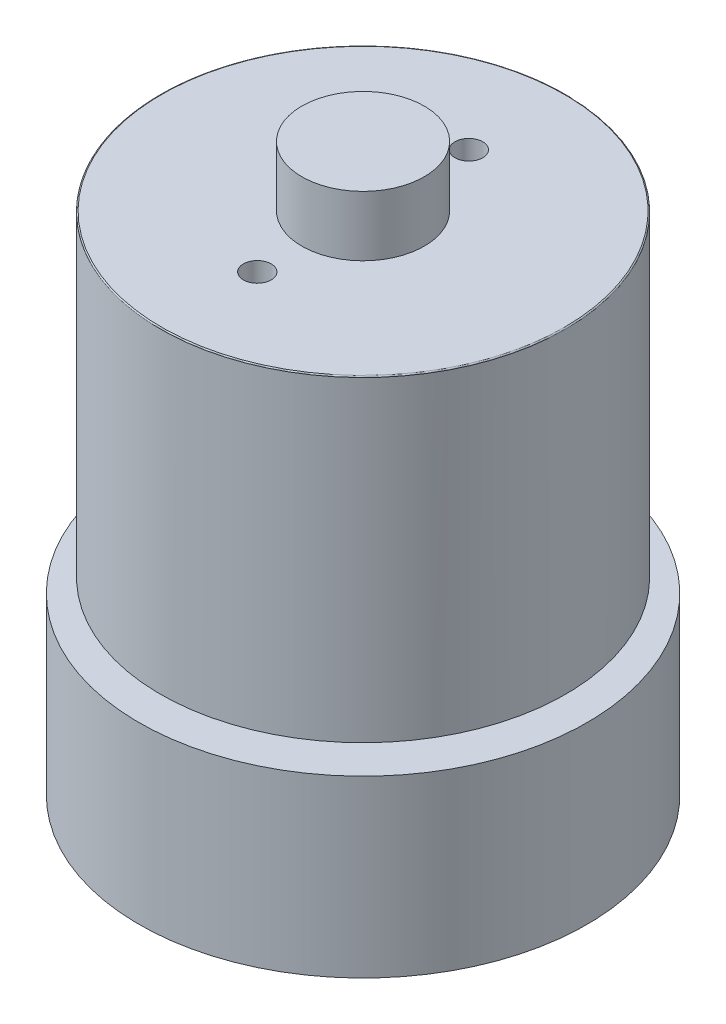
ISO-10303-21;
HEADER;
FILE_DESCRIPTION(('STEP AP214'),'2;1');
FILE_NAME('part.step','',(''),(''),'','','');
FILE_SCHEMA(('AUTOMOTIVE_DESIGN { 1 0 10303 214 1 1 1 1 }'));
ENDSEC;
DATA;
#1=APPLICATION_CONTEXT('core data for automotive mechanical design processes');
#2=APPLICATION_PROTOCOL_DEFINITION('international standard','automotive_design',2000,#1);
#3=PRODUCT_CONTEXT('',#1,'mechanical');
#4=PRODUCT('Part','Part','',(#3));
#5=PRODUCT_RELATED_PRODUCT_CATEGORY('part','',(#4));
#6=PRODUCT_DEFINITION_FORMATION('','',#4);
#7=PRODUCT_DEFINITION_CONTEXT('part definition',#1,'design');
#8=PRODUCT_DEFINITION('design','',#6,#7);
#9=PRODUCT_DEFINITION_SHAPE('','',#8);
#10=(LENGTH_UNIT() NAMED_UNIT(*) SI_UNIT(.MILLI.,.METRE.));
#11=(NAMED_UNIT(*) PLANE_ANGLE_UNIT() SI_UNIT($,.RADIAN.));
#12=(NAMED_UNIT(*) SI_UNIT($,.STERADIAN.) SOLID_ANGLE_UNIT());
#13=UNCERTAINTY_MEASURE_WITH_UNIT(LENGTH_MEASURE(1.E-05),#10,'distance_accuracy_value','');
#14=(GEOMETRIC_REPRESENTATION_CONTEXT(3) GLOBAL_UNCERTAINTY_ASSIGNED_CONTEXT((#13)) GLOBAL_UNIT_ASSIGNED_CONTEXT((#10,
#11,#12)) REPRESENTATION_CONTEXT('',''));
#15=CARTESIAN_POINT('',(0.,0.,0.));
#16=DIRECTION('',(0.,0.,1.));
#17=DIRECTION('',(1.,0.,0.));
#18=AXIS2_PLACEMENT_3D('',#15,#16,#17);
#19=CARTESIAN_POINT('',(0.,0.,0.));
#20=DIRECTION('',(0.,1.,0.));
#21=DIRECTION('',(-1.,0.,0.));
#22=AXIS2_PLACEMENT_3D('',#19,#20,#21);
#23=PLANE('',#22);
#24=CARTESIAN_POINT('',(-16.,0.,0.));
#25=DIRECTION('',(0.,-1.,0.));
#26=DIRECTION('',(0.,0.,-1.));
#27=AXIS2_PLACEMENT_3D('',#24,#25,#26);
#28=CIRCLE('',#27,1.25);
#29=CARTESIAN_POINT('',(-16.,0.,-1.25));
#30=VERTEX_POINT('',#29);
#31=EDGE_CURVE('E93',#30,#30,#28,.T.);
#32=ORIENTED_EDGE('',*,*,#31,.F.);
#33=EDGE_LOOP('',(#32));
#34=FACE_BOUND('',#33,.T.);
#35=CARTESIAN_POINT('',(16.,0.,0.));
#36=DIRECTION('',(0.,-1.,0.));
#37=DIRECTION('',(0.,0.,-1.));
#38=AXIS2_PLACEMENT_3D('',#35,#36,#37);
#39=CIRCLE('',#38,1.25);
#40=CARTESIAN_POINT('',(16.,0.,-1.25));
#41=VERTEX_POINT('',#40);
#42=EDGE_CURVE('E99',#41,#41,#39,.T.);
#43=ORIENTED_EDGE('',*,*,#42,.F.);
#44=EDGE_LOOP('',(#43));
#45=FACE_BOUND('',#44,.T.);
#46=CARTESIAN_POINT('',(0.,0.,0.));
#47=DIRECTION('',(0.,1.,0.));
#48=DIRECTION('',(-1.,0.,0.));
#49=AXIS2_PLACEMENT_3D('',#46,#47,#48);
#50=CIRCLE('',#49,20.115);
#51=CARTESIAN_POINT('',(-20.115,0.,0.));
#52=VERTEX_POINT('',#51);
#53=EDGE_CURVE('E123',#52,#52,#50,.T.);
#54=ORIENTED_EDGE('',*,*,#53,.F.);
#55=EDGE_LOOP('',(#54));
#56=FACE_BOUND('',#55,.T.);
#57=ADVANCED_FACE('F51',(#34,#45,#56),#23,.F.);
#58=CARTESIAN_POINT('',(0.,50.85,0.));
#59=DIRECTION('',(0.,1.,0.));
#60=DIRECTION('',(-1.,0.,0.));
#61=AXIS2_PLACEMENT_3D('',#58,#59,#60);
#62=CYLINDRICAL_SURFACE('',#61,20.115);
#63=CARTESIAN_POINT('',(0.,15.7,0.));
#64=DIRECTION('',(0.,1.,0.));
#65=DIRECTION('',(-1.,0.,0.));
#66=AXIS2_PLACEMENT_3D('',#63,#64,#65);
#67=CIRCLE('',#66,20.115);
#68=CARTESIAN_POINT('',(-20.115,15.7,0.));
#69=VERTEX_POINT('',#68);
#70=EDGE_CURVE('E120',#69,#69,#67,.T.);
#71=ORIENTED_EDGE('',*,*,#70,.F.);
#72=EDGE_LOOP('',(#71));
#73=FACE_BOUND('',#72,.T.);
#74=ORIENTED_EDGE('',*,*,#53,.T.);
#75=EDGE_LOOP('',(#74));
#76=FACE_BOUND('',#75,.T.);
#77=ADVANCED_FACE('F140',(#73,#76),#62,.T.);
#78=CARTESIAN_POINT('',(20.115,15.7,0.));
#79=DIRECTION('',(0.,-1.,0.));
#80=DIRECTION('',(1.,0.,0.));
#81=AXIS2_PLACEMENT_3D('',#78,#79,#80);
#82=PLANE('',#81);
#83=CARTESIAN_POINT('',(0.,15.7,0.));
#84=DIRECTION('',(0.,1.,0.));
#85=DIRECTION('',(-1.,0.,0.));
#86=AXIS2_PLACEMENT_3D('',#83,#84,#85);
#87=CIRCLE('',#86,10.115);
#88=CARTESIAN_POINT('',(-10.115,15.7,0.));
#89=VERTEX_POINT('',#88);
#90=EDGE_CURVE('E117',#89,#89,#87,.T.);
#91=ORIENTED_EDGE('',*,*,#90,.F.);
#92=EDGE_LOOP('',(#91));
#93=FACE_BOUND('',#92,.T.);
#94=ORIENTED_EDGE('',*,*,#70,.T.);
#95=EDGE_LOOP('',(#94));
#96=FACE_BOUND('',#95,.T.);
#97=ADVANCED_FACE('F147',(#93,#96),#82,.F.);
#98=CARTESIAN_POINT('',(0.,50.85,0.));
#99=DIRECTION('',(0.,1.,0.));
#100=DIRECTION('',(-1.,0.,0.));
#101=AXIS2_PLACEMENT_3D('',#98,#99,#100);
#102=CYLINDRICAL_SURFACE('',#101,10.115);
#103=CARTESIAN_POINT('',(0.,16.95,0.));
#104=DIRECTION('',(0.,1.,0.));
#105=DIRECTION('',(-1.,0.,0.));
#106=AXIS2_PLACEMENT_3D('',#103,#104,#105);
#107=CIRCLE('',#106,10.115);
#108=CARTESIAN_POINT('',(-10.115,16.95,0.));
#109=VERTEX_POINT('',#108);
#110=EDGE_CURVE('E114',#109,#109,#107,.T.);
#111=ORIENTED_EDGE('',*,*,#110,.F.);
#112=EDGE_LOOP('',(#111));
#113=FACE_BOUND('',#112,.T.);
#114=ORIENTED_EDGE('',*,*,#90,.T.);
#115=EDGE_LOOP('',(#114));
#116=FACE_BOUND('',#115,.T.);
#117=ADVANCED_FACE('F155',(#113,#116),#102,.T.);
#118=CARTESIAN_POINT('',(10.115,16.95,0.));
#119=DIRECTION('',(0.,1.,0.));
#120=DIRECTION('',(-1.,0.,0.));
#121=AXIS2_PLACEMENT_3D('',#118,#119,#120);
#122=PLANE('',#121);
#123=CARTESIAN_POINT('',(0.,16.95,0.));
#124=DIRECTION('',(0.,1.,0.));
#125=DIRECTION('',(-1.,0.,0.));
#126=AXIS2_PLACEMENT_3D('',#123,#124,#125);
#127=CIRCLE('',#126,18.2);
#128=CARTESIAN_POINT('',(-18.2,16.95,0.));
#129=VERTEX_POINT('',#128);
#130=EDGE_CURVE('E111',#129,#129,#127,.T.);
#131=ORIENTED_EDGE('',*,*,#130,.F.);
#132=EDGE_LOOP('',(#131));
#133=FACE_BOUND('',#132,.T.);
#134=ORIENTED_EDGE('',*,*,#110,.T.);
#135=EDGE_LOOP('',(#134));
#136=FACE_BOUND('',#135,.T.);
#137=ADVANCED_FACE('F159',(#133,#136),#122,.F.);
#138=CARTESIAN_POINT('',(0.,50.85,0.));
#139=DIRECTION('',(0.,1.,0.));
#140=DIRECTION('',(-1.,0.,0.));
#141=AXIS2_PLACEMENT_3D('',#138,#139,#140);
#142=CYLINDRICAL_SURFACE('',#141,18.2);
#143=CARTESIAN_POINT('',(0.,45.35,0.));
#144=DIRECTION('',(0.,-1.,0.));
#145=DIRECTION('',(1.,0.,0.));
#146=AXIS2_PLACEMENT_3D('',#143,#144,#145);
#147=CIRCLE('',#146,18.2);
#148=CARTESIAN_POINT('',(18.2,45.35,0.));
#149=VERTEX_POINT('',#148);
#150=EDGE_CURVE('E11',#149,#149,#147,.T.);
#151=ORIENTED_EDGE('',*,*,#150,.T.);
#152=EDGE_LOOP('',(#151));
#153=FACE_BOUND('',#152,.T.);
#154=ORIENTED_EDGE('',*,*,#130,.T.);
#155=EDGE_LOOP('',(#154));
#156=FACE_BOUND('',#155,.T.);
#157=ADVANCED_FACE('F163',(#153,#156),#142,.T.);
#158=CARTESIAN_POINT('',(18.2,45.45,0.));
#159=DIRECTION('',(0.,-1.,0.));
#160=DIRECTION('',(1.,0.,0.));
#161=AXIS2_PLACEMENT_3D('',#158,#159,#160);
#162=PLANE('',#161);
#163=CARTESIAN_POINT('',(0.,45.45,0.));
#164=DIRECTION('',(0.,-1.,0.));
#165=DIRECTION('',(1.,0.,0.));
#166=AXIS2_PLACEMENT_3D('',#163,#164,#165);
#167=CIRCLE('',#166,18.1);
#168=CARTESIAN_POINT('',(18.1,45.45,0.));
#169=VERTEX_POINT('',#168);
#170=EDGE_CURVE('E59',#169,#169,#167,.F.);
#171=ORIENTED_EDGE('',*,*,#170,.T.);
#172=EDGE_LOOP('',(#171));
#173=FACE_BOUND('',#172,.T.);
#174=CARTESIAN_POINT('',(0.,45.45,-9.5));
#175=DIRECTION('',(0.,1.,0.));
#176=DIRECTION('',(0.,0.,1.));
#177=AXIS2_PLACEMENT_3D('',#174,#175,#176);
#178=CIRCLE('',#177,1.25);
#179=CARTESIAN_POINT('',(0.,45.45,-8.25));
#180=VERTEX_POINT('',#179);
#181=EDGE_CURVE('E83',#180,#180,#178,.T.);
#182=ORIENTED_EDGE('',*,*,#181,.F.);
#183=EDGE_LOOP('',(#182));
#184=FACE_BOUND('',#183,.T.);
#185=CARTESIAN_POINT('',(0.,45.45,9.5));
#186=DIRECTION('',(0.,1.,0.));
#187=DIRECTION('',(0.,0.,1.));
#188=AXIS2_PLACEMENT_3D('',#185,#186,#187);
#189=CIRCLE('',#188,1.25);
#190=CARTESIAN_POINT('',(0.,45.45,10.75));
#191=VERTEX_POINT('',#190);
#192=EDGE_CURVE('E82',#191,#191,#189,.T.);
#193=ORIENTED_EDGE('',*,*,#192,.F.);
#194=EDGE_LOOP('',(#193));
#195=FACE_BOUND('',#194,.T.);
#196=CARTESIAN_POINT('',(0.,45.45,0.));
#197=DIRECTION('',(0.,1.,0.));
#198=DIRECTION('',(-1.,0.,0.));
#199=AXIS2_PLACEMENT_3D('',#196,#197,#198);
#200=CIRCLE('',#199,5.5);
#201=CARTESIAN_POINT('',(-5.50000000000001,45.45,0.));
#202=VERTEX_POINT('',#201);
#203=EDGE_CURVE('E108',#202,#202,#200,.T.);
#204=ORIENTED_EDGE('',*,*,#203,.F.);
#205=EDGE_LOOP('',(#204));
#206=FACE_BOUND('',#205,.T.);
#207=ADVANCED_FACE('F128',(#173,#184,#195,#206),#162,.F.);
#208=CARTESIAN_POINT('',(0.,50.85,0.));
#209=DIRECTION('',(0.,1.,0.));
#210=DIRECTION('',(-1.,0.,0.));
#211=AXIS2_PLACEMENT_3D('',#208,#209,#210);
#212=CYLINDRICAL_SURFACE('',#211,5.5);
#213=CARTESIAN_POINT('',(0.,50.85,0.));
#214=DIRECTION('',(0.,1.,0.));
#215=DIRECTION('',(-1.,0.,0.));
#216=AXIS2_PLACEMENT_3D('',#213,#214,#215);
#217=CIRCLE('',#216,5.5);
#218=CARTESIAN_POINT('',(-5.50000000000002,50.85,0.));
#219=VERTEX_POINT('',#218);
#220=EDGE_CURVE('E105',#219,#219,#217,.T.);
#221=ORIENTED_EDGE('',*,*,#220,.F.);
#222=EDGE_LOOP('',(#221));
#223=FACE_BOUND('',#222,.T.);
#224=ORIENTED_EDGE('',*,*,#203,.T.);
#225=EDGE_LOOP('',(#224));
#226=FACE_BOUND('',#225,.T.);
#227=ADVANCED_FACE('F169',(#223,#226),#212,.T.);
#228=CARTESIAN_POINT('',(5.49999999999998,50.85,0.));
#229=DIRECTION('',(0.,-1.,0.));
#230=DIRECTION('',(1.,0.,0.));
#231=AXIS2_PLACEMENT_3D('',#228,#229,#230);
#232=PLANE('',#231);
#233=ORIENTED_EDGE('',*,*,#220,.T.);
#234=EDGE_LOOP('',(#233));
#235=FACE_BOUND('',#234,.T.);
#236=ADVANCED_FACE('F172',(#235),#232,.F.);
#237=CARTESIAN_POINT('',(16.,5.,0.));
#238=DIRECTION('',(0.,-1.,0.));
#239=DIRECTION('',(0.,0.,-1.));
#240=AXIS2_PLACEMENT_3D('',#237,#238,#239);
#241=CONICAL_SURFACE('',#240,1.25,1.02974425867665);
#242=CARTESIAN_POINT('',(16.,5.75107577378445,0.));
#243=VERTEX_POINT('',#242);
#244=VERTEX_LOOP('',#243);
#245=FACE_BOUND('',#244,.T.);
#246=CARTESIAN_POINT('',(16.,5.,0.));
#247=DIRECTION('',(0.,-1.,0.));
#248=DIRECTION('',(0.,0.,-1.));
#249=AXIS2_PLACEMENT_3D('',#246,#247,#248);
#250=CIRCLE('',#249,1.25);
#251=CARTESIAN_POINT('',(16.,5.,-1.25));
#252=VERTEX_POINT('',#251);
#253=EDGE_CURVE('E102',#252,#252,#250,.T.);
#254=ORIENTED_EDGE('',*,*,#253,.T.);
#255=EDGE_LOOP('',(#254));
#256=FACE_BOUND('',#255,.T.);
#257=ADVANCED_FACE('F176',(#245,#256),#241,.F.);
#258=CARTESIAN_POINT('',(16.,0.,0.));
#259=DIRECTION('',(0.,-1.,0.));
#260=DIRECTION('',(0.,0.,-1.));
#261=AXIS2_PLACEMENT_3D('',#258,#259,#260);
#262=CYLINDRICAL_SURFACE('',#261,1.25);
#263=ORIENTED_EDGE('',*,*,#253,.F.);
#264=EDGE_LOOP('',(#263));
#265=FACE_BOUND('',#264,.T.);
#266=ORIENTED_EDGE('',*,*,#42,.T.);
#267=EDGE_LOOP('',(#266));
#268=FACE_BOUND('',#267,.T.);
#269=ADVANCED_FACE('F180',(#265,#268),#262,.F.);
#270=CARTESIAN_POINT('',(-16.,4.99999999999999,0.));
#271=DIRECTION('',(0.,-1.,0.));
#272=DIRECTION('',(0.,0.,-1.));
#273=AXIS2_PLACEMENT_3D('',#270,#271,#272);
#274=CONICAL_SURFACE('',#273,1.25,1.02974425867665);
#275=CARTESIAN_POINT('',(-16.,5.75107577378444,0.));
#276=VERTEX_POINT('',#275);
#277=VERTEX_LOOP('',#276);
#278=FACE_BOUND('',#277,.T.);
#279=CARTESIAN_POINT('',(-16.,4.99999999999999,0.));
#280=DIRECTION('',(0.,-1.,0.));
#281=DIRECTION('',(0.,0.,-1.));
#282=AXIS2_PLACEMENT_3D('',#279,#280,#281);
#283=CIRCLE('',#282,1.25);
#284=CARTESIAN_POINT('',(-16.,4.99999999999999,-1.25));
#285=VERTEX_POINT('',#284);
#286=EDGE_CURVE('E96',#285,#285,#283,.T.);
#287=ORIENTED_EDGE('',*,*,#286,.T.);
#288=EDGE_LOOP('',(#287));
#289=FACE_BOUND('',#288,.T.);
#290=ADVANCED_FACE('F183',(#278,#289),#274,.F.);
#291=CARTESIAN_POINT('',(-16.,0.,0.));
#292=DIRECTION('',(0.,-1.,0.));
#293=DIRECTION('',(0.,0.,-1.));
#294=AXIS2_PLACEMENT_3D('',#291,#292,#293);
#295=CYLINDRICAL_SURFACE('',#294,1.25);
#296=ORIENTED_EDGE('',*,*,#286,.F.);
#297=EDGE_LOOP('',(#296));
#298=FACE_BOUND('',#297,.T.);
#299=ORIENTED_EDGE('',*,*,#31,.T.);
#300=EDGE_LOOP('',(#299));
#301=FACE_BOUND('',#300,.T.);
#302=ADVANCED_FACE('F187',(#298,#301),#295,.F.);
#303=CARTESIAN_POINT('',(0.,40.45,9.5));
#304=DIRECTION('',(0.,1.,0.));
#305=DIRECTION('',(0.,0.,1.));
#306=AXIS2_PLACEMENT_3D('',#303,#304,#305);
#307=CONICAL_SURFACE('',#306,1.25,1.02974425867665);
#308=CARTESIAN_POINT('',(0.,39.6989242262155,9.5));
#309=VERTEX_POINT('',#308);
#310=VERTEX_LOOP('',#309);
#311=FACE_BOUND('',#310,.T.);
#312=CARTESIAN_POINT('',(0.,40.45,9.5));
#313=DIRECTION('',(0.,1.,0.));
#314=DIRECTION('',(0.,0.,1.));
#315=AXIS2_PLACEMENT_3D('',#312,#313,#314);
#316=CIRCLE('',#315,1.25);
#317=CARTESIAN_POINT('',(0.,40.45,10.75));
#318=VERTEX_POINT('',#317);
#319=EDGE_CURVE('E86',#318,#318,#316,.T.);
#320=ORIENTED_EDGE('',*,*,#319,.T.);
#321=EDGE_LOOP('',(#320));
#322=FACE_BOUND('',#321,.T.);
#323=ADVANCED_FACE('F190',(#311,#322),#307,.F.);
#324=CARTESIAN_POINT('',(0.,45.45,9.5));
#325=DIRECTION('',(0.,1.,0.));
#326=DIRECTION('',(0.,0.,1.));
#327=AXIS2_PLACEMENT_3D('',#324,#325,#326);
#328=CYLINDRICAL_SURFACE('',#327,1.25);
#329=ORIENTED_EDGE('',*,*,#319,.F.);
#330=EDGE_LOOP('',(#329));
#331=FACE_BOUND('',#330,.T.);
#332=ORIENTED_EDGE('',*,*,#192,.T.);
#333=EDGE_LOOP('',(#332));
#334=FACE_BOUND('',#333,.T.);
#335=ADVANCED_FACE('F76',(#331,#334),#328,.F.);
#336=CARTESIAN_POINT('',(0.,40.45,-9.5));
#337=DIRECTION('',(0.,1.,0.));
#338=DIRECTION('',(0.,0.,1.));
#339=AXIS2_PLACEMENT_3D('',#336,#337,#338);
#340=CONICAL_SURFACE('',#339,1.25,1.02974425867665);
#341=CARTESIAN_POINT('',(0.,39.6989242262155,-9.5));
#342=VERTEX_POINT('',#341);
#343=VERTEX_LOOP('',#342);
#344=FACE_BOUND('',#343,.T.);
#345=CARTESIAN_POINT('',(0.,40.45,-9.5));
#346=DIRECTION('',(0.,1.,0.));
#347=DIRECTION('',(0.,0.,1.));
#348=AXIS2_PLACEMENT_3D('',#345,#346,#347);
#349=CIRCLE('',#348,1.25);
#350=CARTESIAN_POINT('',(0.,40.45,-8.25));
#351=VERTEX_POINT('',#350);
#352=EDGE_CURVE('E80',#351,#351,#349,.T.);
#353=ORIENTED_EDGE('',*,*,#352,.T.);
#354=EDGE_LOOP('',(#353));
#355=FACE_BOUND('',#354,.T.);
#356=ADVANCED_FACE('F72',(#344,#355),#340,.F.);
#357=CARTESIAN_POINT('',(0.,45.45,-9.5));
#358=DIRECTION('',(0.,1.,0.));
#359=DIRECTION('',(0.,0.,1.));
#360=AXIS2_PLACEMENT_3D('',#357,#358,#359);
#361=CYLINDRICAL_SURFACE('',#360,1.25);
#362=ORIENTED_EDGE('',*,*,#352,.F.);
#363=EDGE_LOOP('',(#362));
#364=FACE_BOUND('',#363,.T.);
#365=ORIENTED_EDGE('',*,*,#181,.T.);
#366=EDGE_LOOP('',(#365));
#367=FACE_BOUND('',#366,.T.);
#368=ADVANCED_FACE('F75',(#364,#367),#361,.F.);
#369=CARTESIAN_POINT('',(0.,45.35,0.));
#370=DIRECTION('',(0.,-1.,0.));
#371=DIRECTION('',(1.,0.,0.));
#372=AXIS2_PLACEMENT_3D('',#369,#370,#371);
#373=TOROIDAL_SURFACE('',#372,18.1,0.1);
#374=ORIENTED_EDGE('',*,*,#150,.F.);
#375=EDGE_LOOP('',(#374));
#376=FACE_BOUND('',#375,.T.);
#377=ORIENTED_EDGE('',*,*,#170,.F.);
#378=EDGE_LOOP('',(#377));
#379=FACE_BOUND('',#378,.T.);
#380=ADVANCED_FACE('F53',(#376,#379),#373,.T.);
#381=CLOSED_SHELL('',(#57,#77,#97,#117,#137,#157,#207,#227,#236,#257,#269,#290,#302,#323,#335,
#356,#368,#380));
#382=MANIFOLD_SOLID_BREP('B2',#381);
#383=ADVANCED_BREP_SHAPE_REPRESENTATION('',(#18,#382),#14);
#384=SHAPE_DEFINITION_REPRESENTATION(#9,#383);
ENDSEC;
END-ISO-10303-21;
